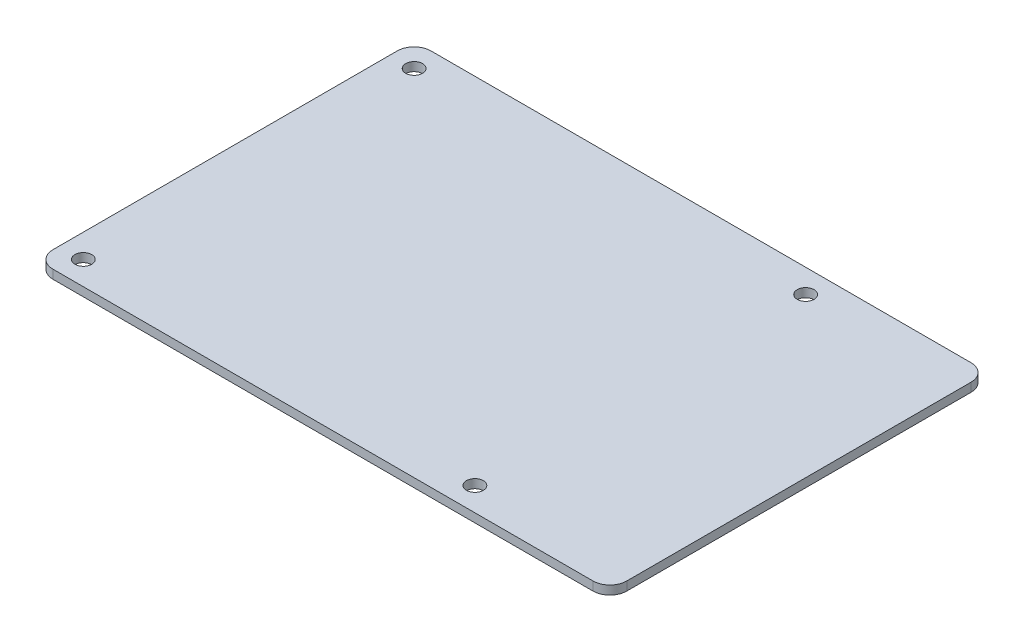
ISO-10303-21;
HEADER;
FILE_DESCRIPTION(('STEP AP214'),'2;1');
FILE_NAME('part.step','',(''),(''),'','','');
FILE_SCHEMA(('AUTOMOTIVE_DESIGN { 1 0 10303 214 1 1 1 1 }'));
ENDSEC;
DATA;
#1=APPLICATION_CONTEXT('core data for automotive mechanical design processes');
#2=APPLICATION_PROTOCOL_DEFINITION('international standard','automotive_design',2000,#1);
#3=PRODUCT_CONTEXT('',#1,'mechanical');
#4=PRODUCT('Part','Part','',(#3));
#5=PRODUCT_RELATED_PRODUCT_CATEGORY('part','',(#4));
#6=PRODUCT_DEFINITION_FORMATION('','',#4);
#7=PRODUCT_DEFINITION_CONTEXT('part definition',#1,'design');
#8=PRODUCT_DEFINITION('design','',#6,#7);
#9=PRODUCT_DEFINITION_SHAPE('','',#8);
#10=(LENGTH_UNIT() NAMED_UNIT(*) SI_UNIT(.MILLI.,.METRE.));
#11=(NAMED_UNIT(*) PLANE_ANGLE_UNIT() SI_UNIT($,.RADIAN.));
#12=(NAMED_UNIT(*) SI_UNIT($,.STERADIAN.) SOLID_ANGLE_UNIT());
#13=UNCERTAINTY_MEASURE_WITH_UNIT(LENGTH_MEASURE(1.E-05),#10,'distance_accuracy_value','');
#14=(GEOMETRIC_REPRESENTATION_CONTEXT(3) GLOBAL_UNCERTAINTY_ASSIGNED_CONTEXT((#13)) GLOBAL_UNIT_ASSIGNED_CONTEXT((#10,
#11,#12)) REPRESENTATION_CONTEXT('',''));
#15=CARTESIAN_POINT('',(0.,0.,0.));
#16=DIRECTION('',(0.,0.,1.));
#17=DIRECTION('',(1.,0.,0.));
#18=AXIS2_PLACEMENT_3D('',#15,#16,#17);
#19=CARTESIAN_POINT('',(39.9999999999725,-1.3,25.5000000000432));
#20=DIRECTION('',(0.,1.,0.));
#21=DIRECTION('',(0.,0.,1.));
#22=AXIS2_PLACEMENT_3D('',#19,#20,#21);
#23=CYLINDRICAL_SURFACE('',#22,2.50000000000001);
#24=CARTESIAN_POINT('',(39.9999999999725,0.,25.5000000000432));
#25=DIRECTION('',(0.,1.,0.));
#26=DIRECTION('',(0.,0.,1.));
#27=AXIS2_PLACEMENT_3D('',#24,#25,#26);
#28=CIRCLE('',#27,2.50000000000001);
#29=CARTESIAN_POINT('',(39.9999999999698,0.,28.0000000000432));
#30=VERTEX_POINT('',#29);
#31=CARTESIAN_POINT('',(42.4999999999725,0.,25.5000000000459));
#32=VERTEX_POINT('',#31);
#33=EDGE_CURVE('E132',#30,#32,#28,.T.);
#34=ORIENTED_EDGE('',*,*,#33,.F.);
#35=DIRECTION('',(0.,1.,0.));
#36=VECTOR('',#35,1.);
#37=CARTESIAN_POINT('',(39.9999999999698,-1.3,28.0000000000432));
#38=LINE('',#37,#36);
#39=CARTESIAN_POINT('',(39.9999999999698,-1.3,28.0000000000432));
#40=VERTEX_POINT('',#39);
#41=EDGE_CURVE('E11',#40,#30,#38,.T.);
#42=ORIENTED_EDGE('',*,*,#41,.F.);
#43=CARTESIAN_POINT('',(39.9999999999725,-1.3,25.5000000000432));
#44=DIRECTION('',(0.,1.,0.));
#45=DIRECTION('',(0.,0.,1.));
#46=AXIS2_PLACEMENT_3D('',#43,#44,#45);
#47=CIRCLE('',#46,2.50000000000001);
#48=CARTESIAN_POINT('',(42.4999999999725,-1.3,25.5000000000459));
#49=VERTEX_POINT('',#48);
#50=EDGE_CURVE('E153',#40,#49,#47,.T.);
#51=ORIENTED_EDGE('',*,*,#50,.T.);
#52=DIRECTION('',(0.,1.,0.));
#53=VECTOR('',#52,1.);
#54=CARTESIAN_POINT('',(42.4999999999725,-1.3,25.5000000000459));
#55=LINE('',#54,#53);
#56=EDGE_CURVE('E38',#49,#32,#55,.T.);
#57=ORIENTED_EDGE('',*,*,#56,.T.);
#58=EDGE_LOOP('',(#34,#42,#51,#57));
#59=FACE_BOUND('',#58,.T.);
#60=ADVANCED_FACE('F35',(#59),#23,.T.);
#61=CARTESIAN_POINT('',(-40.0000000000302,-1.3,27.9999999999568));
#62=DIRECTION('',(-1.07938831483967E-12,0.,1.));
#63=DIRECTION('',(1.,0.,1.07938831483967E-12));
#64=AXIS2_PLACEMENT_3D('',#61,#62,#63);
#65=PLANE('',#64);
#66=DIRECTION('',(1.,0.,1.07938831483967E-12));
#67=VECTOR('',#66,1.);
#68=CARTESIAN_POINT('',(-40.0000000000302,0.,27.9999999999568));
#69=LINE('',#68,#67);
#70=CARTESIAN_POINT('',(-40.0000000000302,0.,27.9999999999568));
#71=VERTEX_POINT('',#70);
#72=EDGE_CURVE('E151',#71,#30,#69,.T.);
#73=ORIENTED_EDGE('',*,*,#72,.F.);
#74=DIRECTION('',(0.,1.,0.));
#75=VECTOR('',#74,1.);
#76=CARTESIAN_POINT('',(-40.0000000000302,-1.3,27.9999999999568));
#77=LINE('',#76,#75);
#78=CARTESIAN_POINT('',(-40.0000000000302,-1.3,27.9999999999568));
#79=VERTEX_POINT('',#78);
#80=EDGE_CURVE('E44',#79,#71,#77,.T.);
#81=ORIENTED_EDGE('',*,*,#80,.F.);
#82=DIRECTION('',(1.,0.,1.07938831483967E-12));
#83=VECTOR('',#82,1.);
#84=CARTESIAN_POINT('',(-40.0000000000302,-1.3,27.9999999999568));
#85=LINE('',#84,#83);
#86=EDGE_CURVE('E122',#79,#40,#85,.T.);
#87=ORIENTED_EDGE('',*,*,#86,.T.);
#88=ORIENTED_EDGE('',*,*,#41,.T.);
#89=EDGE_LOOP('',(#73,#81,#87,#88));
#90=FACE_BOUND('',#89,.T.);
#91=ADVANCED_FACE('F165',(#90),#65,.T.);
#92=CARTESIAN_POINT('',(-40.0000000000275,-1.3,25.4999999999568));
#93=DIRECTION('',(0.,1.,0.));
#94=DIRECTION('',(0.,0.,1.));
#95=AXIS2_PLACEMENT_3D('',#92,#93,#94);
#96=CYLINDRICAL_SURFACE('',#95,2.50000000000001);
#97=CARTESIAN_POINT('',(-40.0000000000275,0.,25.4999999999568));
#98=DIRECTION('',(0.,1.,0.));
#99=DIRECTION('',(0.,0.,1.));
#100=AXIS2_PLACEMENT_3D('',#97,#98,#99);
#101=CIRCLE('',#100,2.50000000000001);
#102=CARTESIAN_POINT('',(-42.5000000000275,0.,25.4999999999541));
#103=VERTEX_POINT('',#102);
#104=EDGE_CURVE('E109',#103,#71,#101,.T.);
#105=ORIENTED_EDGE('',*,*,#104,.F.);
#106=DIRECTION('',(0.,1.,0.));
#107=VECTOR('',#106,1.);
#108=CARTESIAN_POINT('',(-42.5000000000275,-1.3,25.4999999999541));
#109=LINE('',#108,#107);
#110=CARTESIAN_POINT('',(-42.5000000000275,-1.3,25.4999999999541));
#111=VERTEX_POINT('',#110);
#112=EDGE_CURVE('E104',#111,#103,#109,.T.);
#113=ORIENTED_EDGE('',*,*,#112,.F.);
#114=CARTESIAN_POINT('',(-40.0000000000275,-1.3,25.4999999999568));
#115=DIRECTION('',(0.,1.,0.));
#116=DIRECTION('',(0.,0.,1.));
#117=AXIS2_PLACEMENT_3D('',#114,#115,#116);
#118=CIRCLE('',#117,2.50000000000001);
#119=EDGE_CURVE('E107',#111,#79,#118,.T.);
#120=ORIENTED_EDGE('',*,*,#119,.T.);
#121=ORIENTED_EDGE('',*,*,#80,.T.);
#122=EDGE_LOOP('',(#105,#113,#120,#121));
#123=FACE_BOUND('',#122,.T.);
#124=ADVANCED_FACE('F106',(#123),#96,.T.);
#125=CARTESIAN_POINT('',(-42.4999999999725,-1.3,-25.5000000000458));
#126=DIRECTION('',(-1.,0.,-1.07933814391561E-12));
#127=DIRECTION('',(-1.07933814391561E-12,0.,1.));
#128=AXIS2_PLACEMENT_3D('',#125,#126,#127);
#129=PLANE('',#128);
#130=DIRECTION('',(-1.07933814391561E-12,0.,1.));
#131=VECTOR('',#130,1.);
#132=CARTESIAN_POINT('',(-42.4999999999725,0.,-25.5000000000458));
#133=LINE('',#132,#131);
#134=CARTESIAN_POINT('',(-42.4999999999725,0.,-25.5000000000458));
#135=VERTEX_POINT('',#134);
#136=EDGE_CURVE('E148',#135,#103,#133,.T.);
#137=ORIENTED_EDGE('',*,*,#136,.F.);
#138=DIRECTION('',(0.,1.,0.));
#139=VECTOR('',#138,1.);
#140=CARTESIAN_POINT('',(-42.4999999999725,-1.3,-25.5000000000458));
#141=LINE('',#140,#139);
#142=CARTESIAN_POINT('',(-42.4999999999725,-1.3,-25.5000000000458));
#143=VERTEX_POINT('',#142);
#144=EDGE_CURVE('E114',#143,#135,#141,.T.);
#145=ORIENTED_EDGE('',*,*,#144,.F.);
#146=DIRECTION('',(-1.07933814391561E-12,0.,1.));
#147=VECTOR('',#146,1.);
#148=CARTESIAN_POINT('',(-42.4999999999725,-1.3,-25.5000000000458));
#149=LINE('',#148,#147);
#150=EDGE_CURVE('E120',#143,#111,#149,.T.);
#151=ORIENTED_EDGE('',*,*,#150,.T.);
#152=ORIENTED_EDGE('',*,*,#112,.T.);
#153=EDGE_LOOP('',(#137,#145,#151,#152));
#154=FACE_BOUND('',#153,.T.);
#155=ADVANCED_FACE('F124',(#154),#129,.T.);
#156=CARTESIAN_POINT('',(-39.9999999999725,-1.3,-25.5000000000431));
#157=DIRECTION('',(0.,1.,0.));
#158=DIRECTION('',(0.,0.,1.));
#159=AXIS2_PLACEMENT_3D('',#156,#157,#158);
#160=CYLINDRICAL_SURFACE('',#159,2.5);
#161=CARTESIAN_POINT('',(-39.9999999999725,0.,-25.5000000000431));
#162=DIRECTION('',(0.,1.,0.));
#163=DIRECTION('',(0.,0.,1.));
#164=AXIS2_PLACEMENT_3D('',#161,#162,#163);
#165=CIRCLE('',#164,2.5);
#166=CARTESIAN_POINT('',(-39.9999999999698,0.,-28.0000000000432));
#167=VERTEX_POINT('',#166);
#168=EDGE_CURVE('E145',#167,#135,#165,.T.);
#169=ORIENTED_EDGE('',*,*,#168,.F.);
#170=DIRECTION('',(0.,1.,0.));
#171=VECTOR('',#170,1.);
#172=CARTESIAN_POINT('',(-39.9999999999698,-1.3,-28.0000000000432));
#173=LINE('',#172,#171);
#174=CARTESIAN_POINT('',(-39.9999999999698,-1.3,-28.0000000000432));
#175=VERTEX_POINT('',#174);
#176=EDGE_CURVE('E157',#175,#167,#173,.T.);
#177=ORIENTED_EDGE('',*,*,#176,.F.);
#178=CARTESIAN_POINT('',(-39.9999999999725,-1.3,-25.5000000000431));
#179=DIRECTION('',(0.,1.,0.));
#180=DIRECTION('',(0.,0.,1.));
#181=AXIS2_PLACEMENT_3D('',#178,#179,#180);
#182=CIRCLE('',#181,2.5);
#183=EDGE_CURVE('E125',#175,#143,#182,.T.);
#184=ORIENTED_EDGE('',*,*,#183,.T.);
#185=ORIENTED_EDGE('',*,*,#144,.T.);
#186=EDGE_LOOP('',(#169,#177,#184,#185));
#187=FACE_BOUND('',#186,.T.);
#188=ADVANCED_FACE('F178',(#187),#160,.T.);
#189=CARTESIAN_POINT('',(40.0000000000302,-1.3,-27.9999999999568));
#190=DIRECTION('',(1.07908473823137E-12,0.,-1.));
#191=DIRECTION('',(-1.,0.,-1.07908473823137E-12));
#192=AXIS2_PLACEMENT_3D('',#189,#190,#191);
#193=PLANE('',#192);
#194=DIRECTION('',(-1.,0.,-1.07908473823137E-12));
#195=VECTOR('',#194,1.);
#196=CARTESIAN_POINT('',(40.0000000000302,0.,-27.9999999999568));
#197=LINE('',#196,#195);
#198=CARTESIAN_POINT('',(40.0000000000302,0.,-27.9999999999568));
#199=VERTEX_POINT('',#198);
#200=EDGE_CURVE('E142',#199,#167,#197,.T.);
#201=ORIENTED_EDGE('',*,*,#200,.F.);
#202=DIRECTION('',(0.,1.,0.));
#203=VECTOR('',#202,1.);
#204=CARTESIAN_POINT('',(40.0000000000302,-1.3,-27.9999999999568));
#205=LINE('',#204,#203);
#206=CARTESIAN_POINT('',(40.0000000000302,-1.3,-27.9999999999568));
#207=VERTEX_POINT('',#206);
#208=EDGE_CURVE('E159',#207,#199,#205,.T.);
#209=ORIENTED_EDGE('',*,*,#208,.F.);
#210=DIRECTION('',(-1.,0.,-1.07908473823137E-12));
#211=VECTOR('',#210,1.);
#212=CARTESIAN_POINT('',(40.0000000000302,-1.3,-27.9999999999568));
#213=LINE('',#212,#211);
#214=EDGE_CURVE('E127',#207,#175,#213,.T.);
#215=ORIENTED_EDGE('',*,*,#214,.T.);
#216=ORIENTED_EDGE('',*,*,#176,.T.);
#217=EDGE_LOOP('',(#201,#209,#215,#216));
#218=FACE_BOUND('',#217,.T.);
#219=ADVANCED_FACE('F181',(#218),#193,.T.);
#220=CARTESIAN_POINT('',(40.0000000000275,-1.3,-25.4999999999568));
#221=DIRECTION('',(0.,1.,0.));
#222=DIRECTION('',(0.,0.,1.));
#223=AXIS2_PLACEMENT_3D('',#220,#221,#222);
#224=CYLINDRICAL_SURFACE('',#223,2.5);
#225=CARTESIAN_POINT('',(40.0000000000275,0.,-25.4999999999568));
#226=DIRECTION('',(0.,1.,0.));
#227=DIRECTION('',(0.,0.,1.));
#228=AXIS2_PLACEMENT_3D('',#225,#226,#227);
#229=CIRCLE('',#228,2.5);
#230=CARTESIAN_POINT('',(42.5000000000275,0.,-25.4999999999541));
#231=VERTEX_POINT('',#230);
#232=EDGE_CURVE('E139',#231,#199,#229,.T.);
#233=ORIENTED_EDGE('',*,*,#232,.F.);
#234=DIRECTION('',(0.,1.,0.));
#235=VECTOR('',#234,1.);
#236=CARTESIAN_POINT('',(42.5000000000275,-1.3,-25.4999999999541));
#237=LINE('',#236,#235);
#238=CARTESIAN_POINT('',(42.5000000000275,-1.3,-25.4999999999541));
#239=VERTEX_POINT('',#238);
#240=EDGE_CURVE('E160',#239,#231,#237,.T.);
#241=ORIENTED_EDGE('',*,*,#240,.F.);
#242=CARTESIAN_POINT('',(40.0000000000275,-1.3,-25.4999999999568));
#243=DIRECTION('',(0.,1.,0.));
#244=DIRECTION('',(0.,0.,1.));
#245=AXIS2_PLACEMENT_3D('',#242,#243,#244);
#246=CIRCLE('',#245,2.5);
#247=EDGE_CURVE('E247',#239,#207,#246,.T.);
#248=ORIENTED_EDGE('',*,*,#247,.T.);
#249=ORIENTED_EDGE('',*,*,#208,.T.);
#250=EDGE_LOOP('',(#233,#241,#248,#249));
#251=FACE_BOUND('',#250,.T.);
#252=ADVANCED_FACE('F185',(#251),#224,.T.);
#253=CARTESIAN_POINT('',(42.4999999999725,-1.3,25.5000000000459));
#254=DIRECTION('',(1.,0.,1.07920208717239E-12));
#255=DIRECTION('',(1.07920208717239E-12,0.,-1.));
#256=AXIS2_PLACEMENT_3D('',#253,#254,#255);
#257=PLANE('',#256);
#258=DIRECTION('',(1.07920208717239E-12,0.,-1.));
#259=VECTOR('',#258,1.);
#260=CARTESIAN_POINT('',(42.4999999999725,0.,25.5000000000459));
#261=LINE('',#260,#259);
#262=EDGE_CURVE('E135',#32,#231,#261,.T.);
#263=ORIENTED_EDGE('',*,*,#262,.F.);
#264=ORIENTED_EDGE('',*,*,#56,.F.);
#265=DIRECTION('',(1.07920208717239E-12,0.,-1.));
#266=VECTOR('',#265,1.);
#267=CARTESIAN_POINT('',(42.4999999999725,-1.3,25.5000000000459));
#268=LINE('',#267,#266);
#269=EDGE_CURVE('E245',#49,#239,#268,.T.);
#270=ORIENTED_EDGE('',*,*,#269,.T.);
#271=ORIENTED_EDGE('',*,*,#240,.T.);
#272=EDGE_LOOP('',(#263,#264,#270,#271));
#273=FACE_BOUND('',#272,.T.);
#274=ADVANCED_FACE('F162',(#273),#257,.T.);
#275=CARTESIAN_POINT('',(39.9999999999725,-1.3,25.5000000000432));
#276=DIRECTION('',(0.,1.,0.));
#277=DIRECTION('',(0.,0.,1.));
#278=AXIS2_PLACEMENT_3D('',#275,#276,#277);
#279=PLANE('',#278);
#280=CARTESIAN_POINT('',(18.9999999999601,-1.3,24.499999999993));
#281=DIRECTION('',(0.,1.,0.));
#282=DIRECTION('',(0.,0.,-1.));
#283=AXIS2_PLACEMENT_3D('',#280,#281,#282);
#284=CIRCLE('',#283,1.24999999998654);
#285=CARTESIAN_POINT('',(18.9999999999601,-1.3,23.2500000000064));
#286=VERTEX_POINT('',#285);
#287=EDGE_CURVE('E220',#286,#286,#284,.T.);
#288=ORIENTED_EDGE('',*,*,#287,.T.);
#289=EDGE_LOOP('',(#288));
#290=FACE_BOUND('',#289,.T.);
#291=CARTESIAN_POINT('',(-39.0000000000399,-1.3,24.4999999999304));
#292=DIRECTION('',(0.,1.,0.));
#293=DIRECTION('',(0.,0.,-1.));
#294=AXIS2_PLACEMENT_3D('',#291,#292,#293);
#295=CIRCLE('',#294,1.24999999998655);
#296=CARTESIAN_POINT('',(-39.0000000000399,-1.3,23.2499999999438));
#297=VERTEX_POINT('',#296);
#298=EDGE_CURVE('E228',#297,#297,#295,.T.);
#299=ORIENTED_EDGE('',*,*,#298,.T.);
#300=EDGE_LOOP('',(#299));
#301=FACE_BOUND('',#300,.T.);
#302=CARTESIAN_POINT('',(-38.999999999987,-1.3,-24.5000000000555));
#303=DIRECTION('',(0.,1.,0.));
#304=DIRECTION('',(0.,0.,-1.));
#305=AXIS2_PLACEMENT_3D('',#302,#303,#304);
#306=CIRCLE('',#305,1.24999999998659);
#307=CARTESIAN_POINT('',(-38.999999999987,-1.3,-25.7500000000421));
#308=VERTEX_POINT('',#307);
#309=EDGE_CURVE('E234',#308,#308,#306,.T.);
#310=ORIENTED_EDGE('',*,*,#309,.T.);
#311=EDGE_LOOP('',(#310));
#312=FACE_BOUND('',#311,.T.);
#313=CARTESIAN_POINT('',(19.000000000013,-1.3,-24.499999999993));
#314=DIRECTION('',(0.,1.,0.));
#315=DIRECTION('',(0.,0.,-1.));
#316=AXIS2_PLACEMENT_3D('',#313,#314,#315);
#317=CIRCLE('',#316,1.24999999998654);
#318=CARTESIAN_POINT('',(19.000000000013,-1.3,-25.7499999999795));
#319=VERTEX_POINT('',#318);
#320=EDGE_CURVE('E136',#319,#319,#317,.T.);
#321=ORIENTED_EDGE('',*,*,#320,.T.);
#322=EDGE_LOOP('',(#321));
#323=FACE_BOUND('',#322,.T.);
#324=ORIENTED_EDGE('',*,*,#50,.F.);
#325=ORIENTED_EDGE('',*,*,#86,.F.);
#326=ORIENTED_EDGE('',*,*,#119,.F.);
#327=ORIENTED_EDGE('',*,*,#150,.F.);
#328=ORIENTED_EDGE('',*,*,#183,.F.);
#329=ORIENTED_EDGE('',*,*,#214,.F.);
#330=ORIENTED_EDGE('',*,*,#247,.F.);
#331=ORIENTED_EDGE('',*,*,#269,.F.);
#332=EDGE_LOOP('',(#324,#325,#326,#327,#328,#329,#330,#331));
#333=FACE_BOUND('',#332,.T.);
#334=ADVANCED_FACE('F118',(#290,#301,#312,#323,#333),#279,.F.);
#335=CARTESIAN_POINT('',(39.9999999999725,0.,25.5000000000432));
#336=DIRECTION('',(0.,1.,0.));
#337=DIRECTION('',(0.,0.,1.));
#338=AXIS2_PLACEMENT_3D('',#335,#336,#337);
#339=PLANE('',#338);
#340=CARTESIAN_POINT('',(18.9999999999601,0.,24.499999999993));
#341=DIRECTION('',(0.,1.,0.));
#342=DIRECTION('',(0.,0.,-1.));
#343=AXIS2_PLACEMENT_3D('',#340,#341,#342);
#344=CIRCLE('',#343,1.24999999998654);
#345=CARTESIAN_POINT('',(18.9999999999601,0.,23.2500000000064));
#346=VERTEX_POINT('',#345);
#347=EDGE_CURVE('E223',#346,#346,#344,.T.);
#348=ORIENTED_EDGE('',*,*,#347,.F.);
#349=EDGE_LOOP('',(#348));
#350=FACE_BOUND('',#349,.T.);
#351=CARTESIAN_POINT('',(-39.0000000000399,0.,24.4999999999304));
#352=DIRECTION('',(0.,1.,0.));
#353=DIRECTION('',(0.,0.,-1.));
#354=AXIS2_PLACEMENT_3D('',#351,#352,#353);
#355=CIRCLE('',#354,1.24999999998655);
#356=CARTESIAN_POINT('',(-39.0000000000399,0.,23.2499999999438));
#357=VERTEX_POINT('',#356);
#358=EDGE_CURVE('E225',#357,#357,#355,.T.);
#359=ORIENTED_EDGE('',*,*,#358,.F.);
#360=EDGE_LOOP('',(#359));
#361=FACE_BOUND('',#360,.T.);
#362=CARTESIAN_POINT('',(-38.999999999987,0.,-24.5000000000555));
#363=DIRECTION('',(0.,1.,0.));
#364=DIRECTION('',(0.,0.,-1.));
#365=AXIS2_PLACEMENT_3D('',#362,#363,#364);
#366=CIRCLE('',#365,1.24999999998659);
#367=CARTESIAN_POINT('',(-38.999999999987,0.,-25.7500000000421));
#368=VERTEX_POINT('',#367);
#369=EDGE_CURVE('E231',#368,#368,#366,.T.);
#370=ORIENTED_EDGE('',*,*,#369,.F.);
#371=EDGE_LOOP('',(#370));
#372=FACE_BOUND('',#371,.T.);
#373=CARTESIAN_POINT('',(19.000000000013,0.,-24.499999999993));
#374=DIRECTION('',(0.,1.,0.));
#375=DIRECTION('',(0.,0.,-1.));
#376=AXIS2_PLACEMENT_3D('',#373,#374,#375);
#377=CIRCLE('',#376,1.24999999998654);
#378=CARTESIAN_POINT('',(19.000000000013,0.,-25.7499999999795));
#379=VERTEX_POINT('',#378);
#380=EDGE_CURVE('E237',#379,#379,#377,.T.);
#381=ORIENTED_EDGE('',*,*,#380,.F.);
#382=EDGE_LOOP('',(#381));
#383=FACE_BOUND('',#382,.T.);
#384=ORIENTED_EDGE('',*,*,#33,.T.);
#385=ORIENTED_EDGE('',*,*,#262,.T.);
#386=ORIENTED_EDGE('',*,*,#232,.T.);
#387=ORIENTED_EDGE('',*,*,#200,.T.);
#388=ORIENTED_EDGE('',*,*,#168,.T.);
#389=ORIENTED_EDGE('',*,*,#136,.T.);
#390=ORIENTED_EDGE('',*,*,#104,.T.);
#391=ORIENTED_EDGE('',*,*,#72,.T.);
#392=EDGE_LOOP('',(#384,#385,#386,#387,#388,#389,#390,#391));
#393=FACE_BOUND('',#392,.T.);
#394=ADVANCED_FACE('F164',(#350,#361,#372,#383,#393),#339,.T.);
#395=CARTESIAN_POINT('',(19.000000000013,-1.3,-24.499999999993));
#396=DIRECTION('',(0.,1.,0.));
#397=DIRECTION('',(0.,0.,1.));
#398=AXIS2_PLACEMENT_3D('',#395,#396,#397);
#399=CYLINDRICAL_SURFACE('',#398,1.24999999998654);
#400=ORIENTED_EDGE('',*,*,#320,.F.);
#401=EDGE_LOOP('',(#400));
#402=FACE_BOUND('',#401,.T.);
#403=ORIENTED_EDGE('',*,*,#380,.T.);
#404=EDGE_LOOP('',(#403));
#405=FACE_BOUND('',#404,.T.);
#406=ADVANCED_FACE('F197',(#402,#405),#399,.F.);
#407=CARTESIAN_POINT('',(-38.999999999987,-1.3,-24.5000000000555));
#408=DIRECTION('',(0.,1.,0.));
#409=DIRECTION('',(0.,0.,1.));
#410=AXIS2_PLACEMENT_3D('',#407,#408,#409);
#411=CYLINDRICAL_SURFACE('',#410,1.24999999998659);
#412=ORIENTED_EDGE('',*,*,#309,.F.);
#413=EDGE_LOOP('',(#412));
#414=FACE_BOUND('',#413,.T.);
#415=ORIENTED_EDGE('',*,*,#369,.T.);
#416=EDGE_LOOP('',(#415));
#417=FACE_BOUND('',#416,.T.);
#418=ADVANCED_FACE('F204',(#414,#417),#411,.F.);
#419=CARTESIAN_POINT('',(-39.0000000000399,-1.3,24.4999999999304));
#420=DIRECTION('',(0.,1.,0.));
#421=DIRECTION('',(0.,0.,1.));
#422=AXIS2_PLACEMENT_3D('',#419,#420,#421);
#423=CYLINDRICAL_SURFACE('',#422,1.24999999998655);
#424=ORIENTED_EDGE('',*,*,#298,.F.);
#425=EDGE_LOOP('',(#424));
#426=FACE_BOUND('',#425,.T.);
#427=ORIENTED_EDGE('',*,*,#358,.T.);
#428=EDGE_LOOP('',(#427));
#429=FACE_BOUND('',#428,.T.);
#430=ADVANCED_FACE('F208',(#426,#429),#423,.F.);
#431=CARTESIAN_POINT('',(18.9999999999601,-1.3,24.499999999993));
#432=DIRECTION('',(0.,1.,0.));
#433=DIRECTION('',(0.,0.,1.));
#434=AXIS2_PLACEMENT_3D('',#431,#432,#433);
#435=CYLINDRICAL_SURFACE('',#434,1.24999999998654);
#436=ORIENTED_EDGE('',*,*,#287,.F.);
#437=EDGE_LOOP('',(#436));
#438=FACE_BOUND('',#437,.T.);
#439=ORIENTED_EDGE('',*,*,#347,.T.);
#440=EDGE_LOOP('',(#439));
#441=FACE_BOUND('',#440,.T.);
#442=ADVANCED_FACE('F212',(#438,#441),#435,.F.);
#443=CLOSED_SHELL('',(#60,#91,#124,#155,#188,#219,#252,#274,#334,#394,#406,#418,#430,#442));
#444=MANIFOLD_SOLID_BREP('B2',#443);
#445=ADVANCED_BREP_SHAPE_REPRESENTATION('',(#18,#444),#14);
#446=SHAPE_DEFINITION_REPRESENTATION(#9,#445);
ENDSEC;
END-ISO-10303-21;
